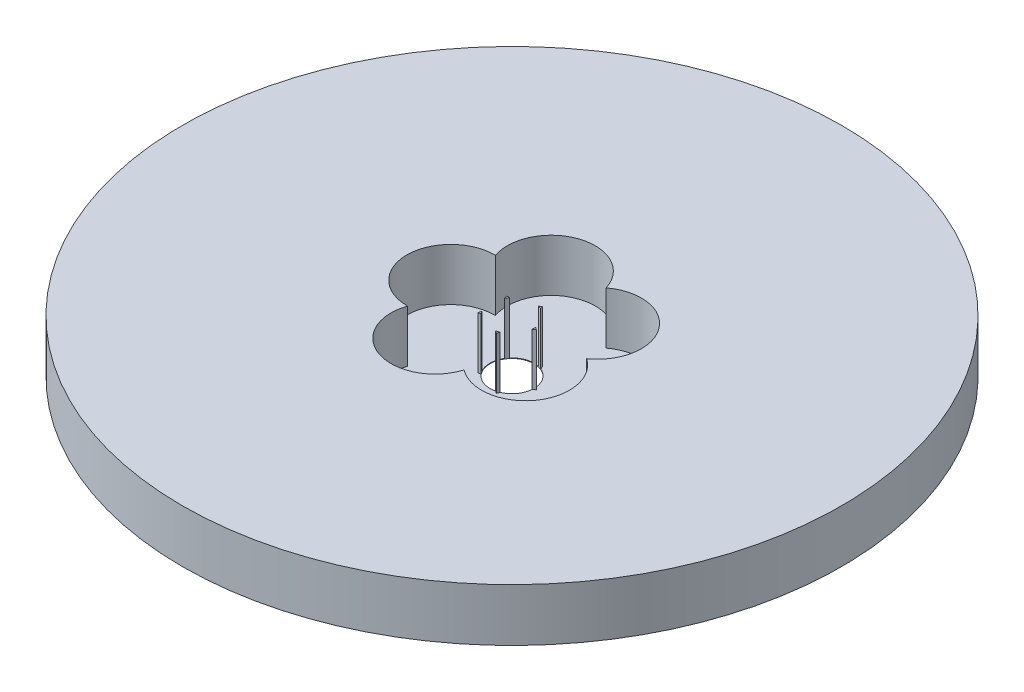
ISO-10303-21;
HEADER;
FILE_DESCRIPTION(('STEP AP214'),'2;1');
FILE_NAME('part.step','',(''),(''),'','','');
FILE_SCHEMA(('AUTOMOTIVE_DESIGN { 1 0 10303 214 1 1 1 1 }'));
ENDSEC;
DATA;
#1=APPLICATION_CONTEXT('core data for automotive mechanical design processes');
#2=APPLICATION_PROTOCOL_DEFINITION('international standard','automotive_design',2000,#1);
#3=PRODUCT_CONTEXT('',#1,'mechanical');
#4=PRODUCT('Part','Part','',(#3));
#5=PRODUCT_RELATED_PRODUCT_CATEGORY('part','',(#4));
#6=PRODUCT_DEFINITION_FORMATION('','',#4);
#7=PRODUCT_DEFINITION_CONTEXT('part definition',#1,'design');
#8=PRODUCT_DEFINITION('design','',#6,#7);
#9=PRODUCT_DEFINITION_SHAPE('','',#8);
#10=(LENGTH_UNIT() NAMED_UNIT(*) SI_UNIT(.MILLI.,.METRE.));
#11=(NAMED_UNIT(*) PLANE_ANGLE_UNIT() SI_UNIT($,.RADIAN.));
#12=(NAMED_UNIT(*) SI_UNIT($,.STERADIAN.) SOLID_ANGLE_UNIT());
#13=UNCERTAINTY_MEASURE_WITH_UNIT(LENGTH_MEASURE(1.E-05),#10,'distance_accuracy_value','');
#14=(GEOMETRIC_REPRESENTATION_CONTEXT(3) GLOBAL_UNCERTAINTY_ASSIGNED_CONTEXT((#13)) GLOBAL_UNIT_ASSIGNED_CONTEXT((#10,
#11,#12)) REPRESENTATION_CONTEXT('',''));
#15=CARTESIAN_POINT('',(0.,0.,0.));
#16=DIRECTION('',(0.,0.,1.));
#17=DIRECTION('',(1.,0.,0.));
#18=AXIS2_PLACEMENT_3D('',#15,#16,#17);
#19=CARTESIAN_POINT('',(0.,12.,0.));
#20=DIRECTION('',(0.,1.,0.));
#21=DIRECTION('',(0.,0.,1.));
#22=AXIS2_PLACEMENT_3D('',#19,#20,#21);
#23=PLANE('',#22);
#24=CARTESIAN_POINT('',(-4.30296790141606,12.,13.2431734711819));
#25=DIRECTION('',(0.,1.,0.));
#26=DIRECTION('',(0.951056516295155,0.,0.309016994374945));
#27=AXIS2_PLACEMENT_3D('',#24,#25,#26);
#28=CIRCLE('',#27,10.);
#29=CARTESIAN_POINT('',(-3.79443456537181,12.,3.25611214934493));
#30=VERTEX_POINT('',#29);
#31=CARTESIAN_POINT('',(-4.4656671650168,12.,3.24449711130185));
#32=VERTEX_POINT('',#31);
#33=EDGE_CURVE('E261',#30,#32,#28,.T.);
#34=ORIENTED_EDGE('',*,*,#33,.F.);
#35=CARTESIAN_POINT('',(0.,12.,0.));
#36=DIRECTION('',(0.,1.,0.));
#37=DIRECTION('',(0.,0.,1.));
#38=AXIS2_PLACEMENT_3D('',#35,#36,#37);
#39=CIRCLE('',#38,5.);
#40=CARTESIAN_POINT('',(-4.26929144216591,12.,2.60252772931413));
#41=VERTEX_POINT('',#40);
#42=EDGE_CURVE('E295',#41,#30,#39,.T.);
#43=ORIENTED_EDGE('',*,*,#42,.F.);
#44=CARTESIAN_POINT('',(-13.9246966339821,12.,0.));
#45=DIRECTION('',(0.,1.,0.));
#46=DIRECTION('',(0.,0.,1.));
#47=AXIS2_PLACEMENT_3D('',#44,#45,#46);
#48=CIRCLE('',#47,10.);
#49=EDGE_CURVE('E292',#32,#41,#48,.T.);
#50=ORIENTED_EDGE('',*,*,#49,.F.);
#51=EDGE_LOOP('',(#34,#43,#50));
#52=FACE_BOUND('',#51,.T.);
#53=ADVANCED_FACE('F39',(#52),#23,.T.);
#54=CARTESIAN_POINT('',(-4.30296790141625,12.,-13.2431734711818));
#55=DIRECTION('',(0.,1.,0.));
#56=DIRECTION('',(-0.95105651629515,0.,0.309016994374958));
#57=AXIS2_PLACEMENT_3D('',#54,#55,#56);
#58=CIRCLE('',#57,10.);
#59=CARTESIAN_POINT('',(-4.46566716501678,12.,-3.24449711130179));
#60=VERTEX_POINT('',#59);
#61=CARTESIAN_POINT('',(-3.79443456537186,12.,-3.25611214934487));
#62=VERTEX_POINT('',#61);
#63=EDGE_CURVE('E214',#60,#62,#58,.T.);
#64=ORIENTED_EDGE('',*,*,#63,.F.);
#65=CARTESIAN_POINT('',(-4.26929144216591,12.,-2.60252772931413));
#66=VERTEX_POINT('',#65);
#67=EDGE_CURVE('E290',#66,#60,#48,.T.);
#68=ORIENTED_EDGE('',*,*,#67,.F.);
#69=EDGE_CURVE('E300',#62,#66,#39,.T.);
#70=ORIENTED_EDGE('',*,*,#69,.F.);
#71=EDGE_LOOP('',(#64,#68,#70));
#72=FACE_BOUND('',#71,.T.);
#73=ADVANCED_FACE('F387',(#72),#23,.T.);
#74=CARTESIAN_POINT('',(11.2653162184071,12.,-8.18473132410142));
#75=DIRECTION('',(0.,1.,0.));
#76=DIRECTION('',(-0.58778525229248,0.,-0.809016994374942));
#77=AXIS2_PLACEMENT_3D('',#74,#75,#76);
#78=CIRCLE('',#77,10.);
#79=CARTESIAN_POINT('',(4.9836567486248,12.,-0.40393738609646));
#80=VERTEX_POINT('',#79);
#81=CARTESIAN_POINT('',(5.51986818084954,12.,0.));
#82=VERTEX_POINT('',#81);
#83=EDGE_CURVE('E202',#80,#82,#78,.T.);
#84=ORIENTED_EDGE('',*,*,#83,.F.);
#85=CARTESIAN_POINT('',(4.98365674862481,12.,0.403937386096388));
#86=VERTEX_POINT('',#85);
#87=EDGE_CURVE('E350',#86,#80,#39,.T.);
#88=ORIENTED_EDGE('',*,*,#87,.F.);
#89=CARTESIAN_POINT('',(11.2653162184072,12.,8.18473132410126));
#90=DIRECTION('',(0.,1.,0.));
#91=DIRECTION('',(0.587785252292469,0.,-0.809016994374951));
#92=AXIS2_PLACEMENT_3D('',#89,#90,#91);
#93=CIRCLE('',#92,10.);
#94=EDGE_CURVE('E243',#82,#86,#93,.T.);
#95=ORIENTED_EDGE('',*,*,#94,.F.);
#96=EDGE_LOOP('',(#84,#88,#95));
#97=FACE_BOUND('',#96,.T.);
#98=ADVANCED_FACE('F392',(#97),#23,.T.);
#99=CARTESIAN_POINT('',(1.92420191267872,12.,4.61491570879074));
#100=VERTEX_POINT('',#99);
#101=CARTESIAN_POINT('',(1.70573307459206,12.,5.24970660248723));
#102=VERTEX_POINT('',#101);
#103=EDGE_CURVE('E244',#100,#102,#93,.T.);
#104=ORIENTED_EDGE('',*,*,#103,.F.);
#105=CARTESIAN_POINT('',(1.15586734623424,12.,4.86456274272513));
#106=VERTEX_POINT('',#105);
#107=EDGE_CURVE('E296',#106,#100,#39,.T.);
#108=ORIENTED_EDGE('',*,*,#107,.F.);
#109=EDGE_CURVE('E259',#102,#106,#28,.T.);
#110=ORIENTED_EDGE('',*,*,#109,.F.);
#111=EDGE_LOOP('',(#104,#108,#110));
#112=FACE_BOUND('',#111,.T.);
#113=ADVANCED_FACE('F352',(#112),#23,.T.);
#114=CARTESIAN_POINT('',(1.70573307459198,12.,-5.24970660248725));
#115=VERTEX_POINT('',#114);
#116=CARTESIAN_POINT('',(1.92420191267865,12.,-4.61491570879077));
#117=VERTEX_POINT('',#116);
#118=EDGE_CURVE('E208',#115,#117,#78,.T.);
#119=ORIENTED_EDGE('',*,*,#118,.F.);
#120=CARTESIAN_POINT('',(1.15586734623418,12.,-4.86456274272514));
#121=VERTEX_POINT('',#120);
#122=EDGE_CURVE('E216',#121,#115,#58,.T.);
#123=ORIENTED_EDGE('',*,*,#122,.F.);
#124=EDGE_CURVE('E233',#117,#121,#39,.T.);
#125=ORIENTED_EDGE('',*,*,#124,.F.);
#126=EDGE_LOOP('',(#119,#123,#125));
#127=FACE_BOUND('',#126,.T.);
#128=ADVANCED_FACE('F232',(#127),#23,.T.);
#129=CARTESIAN_POINT('',(-13.9246966339821,0.126883139533967,0.));
#130=DIRECTION('',(0.,1.,0.));
#131=DIRECTION('',(0.,0.,1.));
#132=AXIS2_PLACEMENT_3D('',#129,#130,#131);
#133=CYLINDRICAL_SURFACE('',#132,10.);
#134=CARTESIAN_POINT('',(-13.9246966339821,0.126883139533967,0.));
#135=DIRECTION('',(0.,1.,0.));
#136=DIRECTION('',(0.,0.,1.));
#137=AXIS2_PLACEMENT_3D('',#134,#135,#136);
#138=CIRCLE('',#137,10.);
#139=CARTESIAN_POINT('',(-4.4656671650168,0.126883139533967,3.24449711130185));
#140=VERTEX_POINT('',#139);
#141=CARTESIAN_POINT('',(-4.26929144216591,0.126883139533967,2.60252772931413));
#142=VERTEX_POINT('',#141);
#143=EDGE_CURVE('E65',#140,#142,#138,.T.);
#144=ORIENTED_EDGE('',*,*,#143,.F.);
#145=DIRECTION('',(0.,1.,0.));
#146=VECTOR('',#145,1.);
#147=CARTESIAN_POINT('',(-4.4656671650168,6.06344156976698,3.24449711130185));
#148=LINE('',#147,#146);
#149=EDGE_CURVE('E269',#140,#32,#148,.T.);
#150=ORIENTED_EDGE('',*,*,#149,.T.);
#151=ORIENTED_EDGE('',*,*,#49,.T.);
#152=DIRECTION('',(0.,1.,0.));
#153=VECTOR('',#152,1.);
#154=CARTESIAN_POINT('',(-4.26929144216591,6.06344156976698,2.60252772931412));
#155=LINE('',#154,#153);
#156=EDGE_CURVE('E306',#41,#142,#155,.F.);
#157=ORIENTED_EDGE('',*,*,#156,.T.);
#158=EDGE_LOOP('',(#144,#150,#151,#157));
#159=FACE_BOUND('',#158,.T.);
#160=ADVANCED_FACE('F406',(#159),#133,.F.);
#161=CARTESIAN_POINT('',(-13.7619973703816,12.,-9.99867635988003));
#162=VERTEX_POINT('',#161);
#163=CARTESIAN_POINT('',(-13.7619973703814,12.,9.99867635988003));
#164=VERTEX_POINT('',#163);
#165=EDGE_CURVE('E289',#162,#164,#48,.T.);
#166=ORIENTED_EDGE('',*,*,#165,.T.);
#167=DIRECTION('',(0.,1.,0.));
#168=VECTOR('',#167,1.);
#169=CARTESIAN_POINT('',(-13.7619973703814,6.06344156976698,9.99867635988003));
#170=LINE('',#169,#168);
#171=CARTESIAN_POINT('',(-13.7619973703814,0.126883139533967,9.99867635988003));
#172=VERTEX_POINT('',#171);
#173=EDGE_CURVE('E270',#164,#172,#170,.F.);
#174=ORIENTED_EDGE('',*,*,#173,.T.);
#175=CARTESIAN_POINT('',(-13.7619973703816,0.126883139533967,-9.99867635988003));
#176=VERTEX_POINT('',#175);
#177=EDGE_CURVE('E286',#176,#172,#138,.T.);
#178=ORIENTED_EDGE('',*,*,#177,.F.);
#179=DIRECTION('',(0.,1.,0.));
#180=VECTOR('',#179,1.);
#181=CARTESIAN_POINT('',(-13.7619973703816,6.06344156976698,-9.99867635988003));
#182=LINE('',#181,#180);
#183=EDGE_CURVE('E204',#176,#162,#182,.T.);
#184=ORIENTED_EDGE('',*,*,#183,.T.);
#185=EDGE_LOOP('',(#166,#174,#178,#184));
#186=FACE_BOUND('',#185,.T.);
#187=ADVANCED_FACE('F370',(#186),#133,.F.);
#188=CARTESIAN_POINT('',(0.,12.,0.));
#189=DIRECTION('',(0.,-1.,0.));
#190=DIRECTION('',(0.,0.,-1.));
#191=AXIS2_PLACEMENT_3D('',#188,#189,#190);
#192=CYLINDRICAL_SURFACE('',#191,75.);
#193=CARTESIAN_POINT('',(0.,12.,0.));
#194=DIRECTION('',(0.,1.,0.));
#195=DIRECTION('',(0.,0.,1.));
#196=AXIS2_PLACEMENT_3D('',#193,#194,#195);
#197=CIRCLE('',#196,75.);
#198=CARTESIAN_POINT('',(0.,12.,75.));
#199=VERTEX_POINT('',#198);
#200=EDGE_CURVE('E299',#199,#199,#197,.T.);
#201=ORIENTED_EDGE('',*,*,#200,.F.);
#202=EDGE_LOOP('',(#201));
#203=FACE_BOUND('',#202,.T.);
#204=CARTESIAN_POINT('',(0.,0.,0.));
#205=DIRECTION('',(0.,1.,0.));
#206=DIRECTION('',(0.,0.,1.));
#207=AXIS2_PLACEMENT_3D('',#204,#205,#206);
#208=CIRCLE('',#207,75.);
#209=CARTESIAN_POINT('',(0.,0.,75.));
#210=VERTEX_POINT('',#209);
#211=EDGE_CURVE('E293',#210,#210,#208,.T.);
#212=ORIENTED_EDGE('',*,*,#211,.T.);
#213=EDGE_LOOP('',(#212));
#214=FACE_BOUND('',#213,.T.);
#215=ADVANCED_FACE('F41',(#203,#214),#192,.T.);
#216=CARTESIAN_POINT('',(5.25661524239908,12.,16.1781981927959));
#217=VERTEX_POINT('',#216);
#218=EDGE_CURVE('E252',#164,#217,#28,.T.);
#219=ORIENTED_EDGE('',*,*,#218,.F.);
#220=ORIENTED_EDGE('',*,*,#165,.F.);
#221=CARTESIAN_POINT('',(5.25661524239885,12.,-16.178198192796));
#222=VERTEX_POINT('',#221);
#223=EDGE_CURVE('E211',#222,#162,#58,.T.);
#224=ORIENTED_EDGE('',*,*,#223,.F.);
#225=CARTESIAN_POINT('',(17.0107642559647,12.,-1.23165366794353E-13));
#226=VERTEX_POINT('',#225);
#227=EDGE_CURVE('E198',#226,#222,#78,.T.);
#228=ORIENTED_EDGE('',*,*,#227,.F.);
#229=EDGE_CURVE('E238',#217,#226,#93,.T.);
#230=ORIENTED_EDGE('',*,*,#229,.F.);
#231=EDGE_LOOP('',(#219,#220,#224,#228,#230));
#232=FACE_BOUND('',#231,.T.);
#233=ORIENTED_EDGE('',*,*,#200,.T.);
#234=EDGE_LOOP('',(#233));
#235=FACE_BOUND('',#234,.T.);
#236=ADVANCED_FACE('F362',(#232,#235),#23,.T.);
#237=CARTESIAN_POINT('',(0.,0.,0.));
#238=DIRECTION('',(0.,1.,0.));
#239=DIRECTION('',(0.,0.,1.));
#240=AXIS2_PLACEMENT_3D('',#237,#238,#239);
#241=PLANE('',#240);
#242=CARTESIAN_POINT('',(0.,0.,0.));
#243=DIRECTION('',(0.,1.,0.));
#244=DIRECTION('',(0.,0.,1.));
#245=AXIS2_PLACEMENT_3D('',#242,#243,#244);
#246=CIRCLE('',#245,5.);
#247=CARTESIAN_POINT('',(0.,0.,5.));
#248=VERTEX_POINT('',#247);
#249=EDGE_CURVE('E284',#248,#248,#246,.T.);
#250=ORIENTED_EDGE('',*,*,#249,.T.);
#251=EDGE_LOOP('',(#250));
#252=FACE_BOUND('',#251,.T.);
#253=ORIENTED_EDGE('',*,*,#211,.F.);
#254=EDGE_LOOP('',(#253));
#255=FACE_BOUND('',#254,.T.);
#256=ADVANCED_FACE('F400',(#252,#255),#241,.F.);
#257=CARTESIAN_POINT('',(0.,12.,0.));
#258=DIRECTION('',(0.,-1.,0.));
#259=DIRECTION('',(0.,0.,-1.));
#260=AXIS2_PLACEMENT_3D('',#257,#258,#259);
#261=CYLINDRICAL_SURFACE('',#260,5.);
#262=DIRECTION('',(0.,1.,0.));
#263=VECTOR('',#262,1.);
#264=CARTESIAN_POINT('',(-3.79443456537181,6.06344156976698,3.25611214934493));
#265=LINE('',#264,#263);
#266=CARTESIAN_POINT('',(-3.79443456537181,0.126883139533967,3.25611214934493));
#267=VERTEX_POINT('',#266);
#268=EDGE_CURVE('E274',#267,#30,#265,.T.);
#269=ORIENTED_EDGE('',*,*,#268,.F.);
#270=CARTESIAN_POINT('',(0.,0.126883139533967,0.));
#271=DIRECTION('',(0.,1.,0.));
#272=DIRECTION('',(0.,0.,1.));
#273=AXIS2_PLACEMENT_3D('',#270,#271,#272);
#274=CIRCLE('',#273,5.);
#275=CARTESIAN_POINT('',(1.15586734623424,0.126883139533967,4.86456274272513));
#276=VERTEX_POINT('',#275);
#277=EDGE_CURVE('E280',#267,#276,#274,.T.);
#278=ORIENTED_EDGE('',*,*,#277,.T.);
#279=DIRECTION('',(0.,1.,0.));
#280=VECTOR('',#279,1.);
#281=CARTESIAN_POINT('',(1.15586734623424,6.06344156976698,4.86456274272513));
#282=LINE('',#281,#280);
#283=EDGE_CURVE('E272',#106,#276,#282,.F.);
#284=ORIENTED_EDGE('',*,*,#283,.F.);
#285=ORIENTED_EDGE('',*,*,#107,.T.);
#286=DIRECTION('',(0.,1.,0.));
#287=VECTOR('',#286,1.);
#288=CARTESIAN_POINT('',(1.92420191267872,6.06344156976698,4.61491570879074));
#289=LINE('',#288,#287);
#290=CARTESIAN_POINT('',(1.92420191267872,0.126883139533967,4.61491570879074));
#291=VERTEX_POINT('',#290);
#292=EDGE_CURVE('E11',#291,#100,#289,.T.);
#293=ORIENTED_EDGE('',*,*,#292,.F.);
#294=CARTESIAN_POINT('',(4.98365674862481,0.126883139533967,0.403937386096388));
#295=VERTEX_POINT('',#294);
#296=EDGE_CURVE('E281',#291,#295,#274,.T.);
#297=ORIENTED_EDGE('',*,*,#296,.T.);
#298=DIRECTION('',(0.,1.,0.));
#299=VECTOR('',#298,1.);
#300=CARTESIAN_POINT('',(4.98365674862481,6.06344156976698,0.403937386096388));
#301=LINE('',#300,#299);
#302=EDGE_CURVE('E50',#86,#295,#301,.F.);
#303=ORIENTED_EDGE('',*,*,#302,.F.);
#304=ORIENTED_EDGE('',*,*,#87,.T.);
#305=DIRECTION('',(0.,1.,0.));
#306=VECTOR('',#305,1.);
#307=CARTESIAN_POINT('',(4.9836567486248,6.06344156976698,-0.403937386096459));
#308=LINE('',#307,#306);
#309=CARTESIAN_POINT('',(4.9836567486248,0.126883139533967,-0.40393738609646));
#310=VERTEX_POINT('',#309);
#311=EDGE_CURVE('E312',#310,#80,#308,.T.);
#312=ORIENTED_EDGE('',*,*,#311,.F.);
#313=CARTESIAN_POINT('',(1.92420191267865,0.126883139533967,-4.61491570879077));
#314=VERTEX_POINT('',#313);
#315=EDGE_CURVE('E334',#310,#314,#274,.T.);
#316=ORIENTED_EDGE('',*,*,#315,.T.);
#317=DIRECTION('',(0.,1.,0.));
#318=VECTOR('',#317,1.);
#319=CARTESIAN_POINT('',(1.92420191267865,6.06344156976698,-4.61491570879077));
#320=LINE('',#319,#318);
#321=EDGE_CURVE('E311',#117,#314,#320,.F.);
#322=ORIENTED_EDGE('',*,*,#321,.F.);
#323=ORIENTED_EDGE('',*,*,#124,.T.);
#324=DIRECTION('',(0.,1.,0.));
#325=VECTOR('',#324,1.);
#326=CARTESIAN_POINT('',(1.15586734623418,6.06344156976698,-4.86456274272514));
#327=LINE('',#326,#325);
#328=CARTESIAN_POINT('',(1.15586734623418,0.126883139533967,-4.86456274272514));
#329=VERTEX_POINT('',#328);
#330=EDGE_CURVE('E224',#329,#121,#327,.T.);
#331=ORIENTED_EDGE('',*,*,#330,.F.);
#332=CARTESIAN_POINT('',(-3.79443456537186,0.126883139533967,-3.25611214934487));
#333=VERTEX_POINT('',#332);
#334=EDGE_CURVE('E278',#329,#333,#274,.T.);
#335=ORIENTED_EDGE('',*,*,#334,.T.);
#336=DIRECTION('',(0.,1.,0.));
#337=VECTOR('',#336,1.);
#338=CARTESIAN_POINT('',(-3.79443456537186,6.06344156976698,-3.25611214934487));
#339=LINE('',#338,#337);
#340=EDGE_CURVE('E262',#62,#333,#339,.F.);
#341=ORIENTED_EDGE('',*,*,#340,.F.);
#342=ORIENTED_EDGE('',*,*,#69,.T.);
#343=DIRECTION('',(0.,1.,0.));
#344=VECTOR('',#343,1.);
#345=CARTESIAN_POINT('',(-4.26929144216591,6.06344156976698,-2.60252772931412));
#346=LINE('',#345,#344);
#347=CARTESIAN_POINT('',(-4.26929144216591,0.126883139533967,-2.60252772931413));
#348=VERTEX_POINT('',#347);
#349=EDGE_CURVE('E309',#348,#66,#346,.T.);
#350=ORIENTED_EDGE('',*,*,#349,.F.);
#351=CARTESIAN_POINT('',(0.,0.126883139533967,0.));
#352=DIRECTION('',(0.,1.,0.));
#353=DIRECTION('',(0.,0.,1.));
#354=AXIS2_PLACEMENT_3D('',#351,#352,#353);
#355=CIRCLE('',#354,5.);
#356=EDGE_CURVE('E302',#348,#142,#355,.T.);
#357=ORIENTED_EDGE('',*,*,#356,.T.);
#358=ORIENTED_EDGE('',*,*,#156,.F.);
#359=ORIENTED_EDGE('',*,*,#42,.T.);
#360=EDGE_LOOP('',(#269,#278,#284,#285,#293,#297,#303,#304,#312,#316,#322,#323,#331,#335,#341,
#342,#350,#357,#358,#359));
#361=FACE_BOUND('',#360,.T.);
#362=ORIENTED_EDGE('',*,*,#249,.F.);
#363=EDGE_LOOP('',(#362));
#364=FACE_BOUND('',#363,.T.);
#365=ADVANCED_FACE('F329',(#361,#364),#261,.F.);
#366=ORIENTED_EDGE('',*,*,#67,.T.);
#367=DIRECTION('',(0.,1.,0.));
#368=VECTOR('',#367,1.);
#369=CARTESIAN_POINT('',(-4.46566716501678,6.06344156976698,-3.24449711130179));
#370=LINE('',#369,#368);
#371=CARTESIAN_POINT('',(-4.46566716501678,0.126883139533967,-3.24449711130179));
#372=VERTEX_POINT('',#371);
#373=EDGE_CURVE('E258',#60,#372,#370,.F.);
#374=ORIENTED_EDGE('',*,*,#373,.T.);
#375=EDGE_CURVE('E285',#348,#372,#138,.T.);
#376=ORIENTED_EDGE('',*,*,#375,.F.);
#377=ORIENTED_EDGE('',*,*,#349,.T.);
#378=EDGE_LOOP('',(#366,#374,#376,#377));
#379=FACE_BOUND('',#378,.T.);
#380=ADVANCED_FACE('F345',(#379),#133,.F.);
#381=CARTESIAN_POINT('',(-13.9246966339821,0.126883139533967,0.));
#382=DIRECTION('',(0.,1.,0.));
#383=DIRECTION('',(0.,0.,1.));
#384=AXIS2_PLACEMENT_3D('',#381,#382,#383);
#385=PLANE('',#384);
#386=CARTESIAN_POINT('',(-4.30296790141625,0.126883139533967,-13.2431734711818));
#387=DIRECTION('',(0.,1.,0.));
#388=DIRECTION('',(-0.95105651629515,0.,0.309016994374958));
#389=AXIS2_PLACEMENT_3D('',#386,#387,#388);
#390=CIRCLE('',#389,10.);
#391=CARTESIAN_POINT('',(5.25661524239885,0.126883139533967,-16.178198192796));
#392=VERTEX_POINT('',#391);
#393=EDGE_CURVE('E182',#392,#176,#390,.T.);
#394=ORIENTED_EDGE('',*,*,#393,.T.);
#395=ORIENTED_EDGE('',*,*,#177,.T.);
#396=CARTESIAN_POINT('',(-4.30296790141606,0.126883139533967,13.2431734711819));
#397=DIRECTION('',(0.,1.,0.));
#398=DIRECTION('',(0.951056516295155,0.,0.309016994374945));
#399=AXIS2_PLACEMENT_3D('',#396,#397,#398);
#400=CIRCLE('',#399,10.);
#401=CARTESIAN_POINT('',(5.25661524239908,0.126883139533967,16.1781981927959));
#402=VERTEX_POINT('',#401);
#403=EDGE_CURVE('E256',#172,#402,#400,.T.);
#404=ORIENTED_EDGE('',*,*,#403,.T.);
#405=CARTESIAN_POINT('',(11.2653162184072,0.126883139533967,8.18473132410126));
#406=DIRECTION('',(0.,1.,0.));
#407=DIRECTION('',(0.587785252292469,0.,-0.809016994374951));
#408=AXIS2_PLACEMENT_3D('',#405,#406,#407);
#409=CIRCLE('',#408,10.);
#410=CARTESIAN_POINT('',(17.0107642559647,0.126883139533967,-1.23165366794353E-13));
#411=VERTEX_POINT('',#410);
#412=EDGE_CURVE('E184',#402,#411,#409,.T.);
#413=ORIENTED_EDGE('',*,*,#412,.T.);
#414=CARTESIAN_POINT('',(11.2653162184071,0.126883139533967,-8.18473132410142));
#415=DIRECTION('',(0.,1.,0.));
#416=DIRECTION('',(-0.58778525229248,0.,-0.809016994374942));
#417=AXIS2_PLACEMENT_3D('',#414,#415,#416);
#418=CIRCLE('',#417,10.);
#419=EDGE_CURVE('E176',#411,#392,#418,.T.);
#420=ORIENTED_EDGE('',*,*,#419,.T.);
#421=EDGE_LOOP('',(#394,#395,#404,#413,#420));
#422=FACE_BOUND('',#421,.T.);
#423=ORIENTED_EDGE('',*,*,#375,.T.);
#424=EDGE_CURVE('E53',#372,#333,#390,.T.);
#425=ORIENTED_EDGE('',*,*,#424,.T.);
#426=ORIENTED_EDGE('',*,*,#334,.F.);
#427=CARTESIAN_POINT('',(1.70573307459198,0.126883139533967,-5.24970660248725));
#428=VERTEX_POINT('',#427);
#429=EDGE_CURVE('E210',#329,#428,#390,.T.);
#430=ORIENTED_EDGE('',*,*,#429,.T.);
#431=EDGE_CURVE('E188',#428,#314,#418,.T.);
#432=ORIENTED_EDGE('',*,*,#431,.T.);
#433=ORIENTED_EDGE('',*,*,#315,.F.);
#434=CARTESIAN_POINT('',(5.51986818084954,0.126883139533967,0.));
#435=VERTEX_POINT('',#434);
#436=EDGE_CURVE('E191',#310,#435,#418,.T.);
#437=ORIENTED_EDGE('',*,*,#436,.T.);
#438=EDGE_CURVE('E199',#435,#295,#409,.T.);
#439=ORIENTED_EDGE('',*,*,#438,.T.);
#440=ORIENTED_EDGE('',*,*,#296,.F.);
#441=CARTESIAN_POINT('',(1.70573307459206,0.126883139533967,5.24970660248723));
#442=VERTEX_POINT('',#441);
#443=EDGE_CURVE('E242',#291,#442,#409,.T.);
#444=ORIENTED_EDGE('',*,*,#443,.T.);
#445=EDGE_CURVE('E251',#442,#276,#400,.T.);
#446=ORIENTED_EDGE('',*,*,#445,.T.);
#447=ORIENTED_EDGE('',*,*,#277,.F.);
#448=EDGE_CURVE('E260',#267,#140,#400,.T.);
#449=ORIENTED_EDGE('',*,*,#448,.T.);
#450=ORIENTED_EDGE('',*,*,#143,.T.);
#451=ORIENTED_EDGE('',*,*,#356,.F.);
#452=EDGE_LOOP('',(#423,#425,#426,#430,#432,#433,#437,#439,#440,#444,#446,#447,#449,#450,#451));
#453=FACE_BOUND('',#452,.T.);
#454=ADVANCED_FACE('F177',(#422,#453),#385,.T.);
#455=CARTESIAN_POINT('',(11.2653162184072,0.126883139533967,8.18473132410126));
#456=DIRECTION('',(0.,1.,0.));
#457=DIRECTION('',(0.,0.,1.));
#458=AXIS2_PLACEMENT_3D('',#455,#456,#457);
#459=CYLINDRICAL_SURFACE('',#458,10.);
#460=ORIENTED_EDGE('',*,*,#292,.T.);
#461=ORIENTED_EDGE('',*,*,#103,.T.);
#462=DIRECTION('',(0.,1.,0.));
#463=VECTOR('',#462,1.);
#464=CARTESIAN_POINT('',(1.70573307459206,6.06344156976698,5.24970660248723));
#465=LINE('',#464,#463);
#466=EDGE_CURVE('E248',#442,#102,#465,.T.);
#467=ORIENTED_EDGE('',*,*,#466,.F.);
#468=ORIENTED_EDGE('',*,*,#443,.F.);
#469=EDGE_LOOP('',(#460,#461,#467,#468));
#470=FACE_BOUND('',#469,.T.);
#471=ADVANCED_FACE('F371',(#470),#459,.F.);
#472=CARTESIAN_POINT('',(11.2653162184071,0.126883139533967,-8.18473132410142));
#473=DIRECTION('',(0.,1.,0.));
#474=DIRECTION('',(0.,0.,1.));
#475=AXIS2_PLACEMENT_3D('',#472,#473,#474);
#476=CYLINDRICAL_SURFACE('',#475,10.);
#477=ORIENTED_EDGE('',*,*,#311,.T.);
#478=ORIENTED_EDGE('',*,*,#83,.T.);
#479=DIRECTION('',(0.,1.,0.));
#480=VECTOR('',#479,1.);
#481=CARTESIAN_POINT('',(5.51986818084954,6.06344156976698,0.));
#482=LINE('',#481,#480);
#483=EDGE_CURVE('E240',#435,#82,#482,.T.);
#484=ORIENTED_EDGE('',*,*,#483,.F.);
#485=ORIENTED_EDGE('',*,*,#436,.F.);
#486=EDGE_LOOP('',(#477,#478,#484,#485));
#487=FACE_BOUND('',#486,.T.);
#488=ADVANCED_FACE('F381',(#487),#476,.F.);
#489=CARTESIAN_POINT('',(-4.30296790141606,0.126883139533967,13.2431734711819));
#490=DIRECTION('',(0.,1.,0.));
#491=DIRECTION('',(0.,0.,1.));
#492=AXIS2_PLACEMENT_3D('',#489,#490,#491);
#493=CYLINDRICAL_SURFACE('',#492,10.);
#494=ORIENTED_EDGE('',*,*,#268,.T.);
#495=ORIENTED_EDGE('',*,*,#33,.T.);
#496=ORIENTED_EDGE('',*,*,#149,.F.);
#497=ORIENTED_EDGE('',*,*,#448,.F.);
#498=EDGE_LOOP('',(#494,#495,#496,#497));
#499=FACE_BOUND('',#498,.T.);
#500=ADVANCED_FACE('F374',(#499),#493,.F.);
#501=ORIENTED_EDGE('',*,*,#283,.T.);
#502=ORIENTED_EDGE('',*,*,#445,.F.);
#503=ORIENTED_EDGE('',*,*,#466,.T.);
#504=ORIENTED_EDGE('',*,*,#109,.T.);
#505=EDGE_LOOP('',(#501,#502,#503,#504));
#506=FACE_BOUND('',#505,.T.);
#507=ADVANCED_FACE('F373',(#506),#493,.F.);
#508=ORIENTED_EDGE('',*,*,#218,.T.);
#509=DIRECTION('',(0.,1.,0.));
#510=VECTOR('',#509,1.);
#511=CARTESIAN_POINT('',(5.25661524239908,6.06344156976698,16.1781981927959));
#512=LINE('',#511,#510);
#513=EDGE_CURVE('E231',#217,#402,#512,.F.);
#514=ORIENTED_EDGE('',*,*,#513,.T.);
#515=ORIENTED_EDGE('',*,*,#403,.F.);
#516=ORIENTED_EDGE('',*,*,#173,.F.);
#517=EDGE_LOOP('',(#508,#514,#515,#516));
#518=FACE_BOUND('',#517,.T.);
#519=ADVANCED_FACE('F369',(#518),#493,.F.);
#520=CARTESIAN_POINT('',(-4.30296790141625,0.126883139533967,-13.2431734711818));
#521=DIRECTION('',(0.,1.,0.));
#522=DIRECTION('',(0.,0.,1.));
#523=AXIS2_PLACEMENT_3D('',#520,#521,#522);
#524=CYLINDRICAL_SURFACE('',#523,10.);
#525=ORIENTED_EDGE('',*,*,#330,.T.);
#526=ORIENTED_EDGE('',*,*,#122,.T.);
#527=DIRECTION('',(0.,1.,0.));
#528=VECTOR('',#527,1.);
#529=CARTESIAN_POINT('',(1.70573307459198,6.06344156976698,-5.24970660248725));
#530=LINE('',#529,#528);
#531=EDGE_CURVE('E200',#428,#115,#530,.T.);
#532=ORIENTED_EDGE('',*,*,#531,.F.);
#533=ORIENTED_EDGE('',*,*,#429,.F.);
#534=EDGE_LOOP('',(#525,#526,#532,#533));
#535=FACE_BOUND('',#534,.T.);
#536=ADVANCED_FACE('F219',(#535),#524,.F.);
#537=ORIENTED_EDGE('',*,*,#393,.F.);
#538=DIRECTION('',(0.,1.,0.));
#539=VECTOR('',#538,1.);
#540=CARTESIAN_POINT('',(5.25661524239885,6.06344156976698,-16.178198192796));
#541=LINE('',#540,#539);
#542=EDGE_CURVE('E192',#222,#392,#541,.F.);
#543=ORIENTED_EDGE('',*,*,#542,.F.);
#544=ORIENTED_EDGE('',*,*,#223,.T.);
#545=ORIENTED_EDGE('',*,*,#183,.F.);
#546=EDGE_LOOP('',(#537,#543,#544,#545));
#547=FACE_BOUND('',#546,.T.);
#548=ADVANCED_FACE('F205',(#547),#524,.F.);
#549=ORIENTED_EDGE('',*,*,#340,.T.);
#550=ORIENTED_EDGE('',*,*,#424,.F.);
#551=ORIENTED_EDGE('',*,*,#373,.F.);
#552=ORIENTED_EDGE('',*,*,#63,.T.);
#553=EDGE_LOOP('',(#549,#550,#551,#552));
#554=FACE_BOUND('',#553,.T.);
#555=ADVANCED_FACE('F434',(#554),#524,.F.);
#556=ORIENTED_EDGE('',*,*,#302,.T.);
#557=ORIENTED_EDGE('',*,*,#438,.F.);
#558=ORIENTED_EDGE('',*,*,#483,.T.);
#559=ORIENTED_EDGE('',*,*,#94,.T.);
#560=EDGE_LOOP('',(#556,#557,#558,#559));
#561=FACE_BOUND('',#560,.T.);
#562=ADVANCED_FACE('F317',(#561),#459,.F.);
#563=ORIENTED_EDGE('',*,*,#321,.T.);
#564=ORIENTED_EDGE('',*,*,#431,.F.);
#565=ORIENTED_EDGE('',*,*,#531,.T.);
#566=ORIENTED_EDGE('',*,*,#118,.T.);
#567=EDGE_LOOP('',(#563,#564,#565,#566));
#568=FACE_BOUND('',#567,.T.);
#569=ADVANCED_FACE('F228',(#568),#476,.F.);
#570=ORIENTED_EDGE('',*,*,#229,.T.);
#571=DIRECTION('',(0.,1.,0.));
#572=VECTOR('',#571,1.);
#573=CARTESIAN_POINT('',(17.0107642559647,6.06344156976698,-1.23165366794353E-13));
#574=LINE('',#573,#572);
#575=EDGE_CURVE('E187',#226,#411,#574,.F.);
#576=ORIENTED_EDGE('',*,*,#575,.T.);
#577=ORIENTED_EDGE('',*,*,#412,.F.);
#578=ORIENTED_EDGE('',*,*,#513,.F.);
#579=EDGE_LOOP('',(#570,#576,#577,#578));
#580=FACE_BOUND('',#579,.T.);
#581=ADVANCED_FACE('F358',(#580),#459,.F.);
#582=ORIENTED_EDGE('',*,*,#542,.T.);
#583=ORIENTED_EDGE('',*,*,#419,.F.);
#584=ORIENTED_EDGE('',*,*,#575,.F.);
#585=ORIENTED_EDGE('',*,*,#227,.T.);
#586=EDGE_LOOP('',(#582,#583,#584,#585));
#587=FACE_BOUND('',#586,.T.);
#588=ADVANCED_FACE('F193',(#587),#476,.F.);
#589=CLOSED_SHELL('',(#53,#73,#98,#113,#128,#160,#187,#215,#236,#256,#365,#380,#454,#471,#488,
#500,#507,#519,#536,#548,#555,#562,#569,#581,#588));
#590=MANIFOLD_SOLID_BREP('B2',#589);
#591=ADVANCED_BREP_SHAPE_REPRESENTATION('',(#18,#590),#14);
#592=SHAPE_DEFINITION_REPRESENTATION(#9,#591);
ENDSEC;
END-ISO-10303-21;
